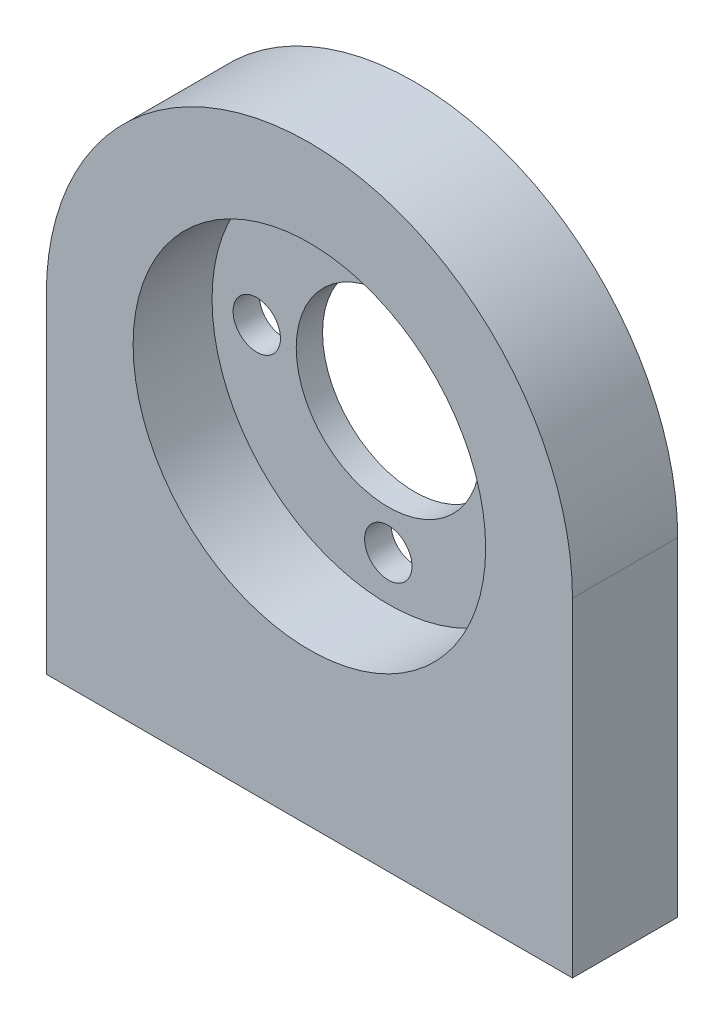
ISO-10303-21;
HEADER;
FILE_DESCRIPTION(('STEP AP214'),'2;1');
FILE_NAME('part.step','',(''),(''),'','','');
FILE_SCHEMA(('AUTOMOTIVE_DESIGN { 1 0 10303 214 1 1 1 1 }'));
ENDSEC;
DATA;
#1=APPLICATION_CONTEXT('core data for automotive mechanical design processes');
#2=APPLICATION_PROTOCOL_DEFINITION('international standard','automotive_design',2000,#1);
#3=PRODUCT_CONTEXT('',#1,'mechanical');
#4=PRODUCT('Part','Part','',(#3));
#5=PRODUCT_RELATED_PRODUCT_CATEGORY('part','',(#4));
#6=PRODUCT_DEFINITION_FORMATION('','',#4);
#7=PRODUCT_DEFINITION_CONTEXT('part definition',#1,'design');
#8=PRODUCT_DEFINITION('design','',#6,#7);
#9=PRODUCT_DEFINITION_SHAPE('','',#8);
#10=(LENGTH_UNIT() NAMED_UNIT(*) SI_UNIT(.MILLI.,.METRE.));
#11=(NAMED_UNIT(*) PLANE_ANGLE_UNIT() SI_UNIT($,.RADIAN.));
#12=(NAMED_UNIT(*) SI_UNIT($,.STERADIAN.) SOLID_ANGLE_UNIT());
#13=UNCERTAINTY_MEASURE_WITH_UNIT(LENGTH_MEASURE(1.E-05),#10,'distance_accuracy_value','');
#14=(GEOMETRIC_REPRESENTATION_CONTEXT(3) GLOBAL_UNCERTAINTY_ASSIGNED_CONTEXT((#13)) GLOBAL_UNIT_ASSIGNED_CONTEXT((#10,
#11,#12)) REPRESENTATION_CONTEXT('',''));
#15=CARTESIAN_POINT('',(0.,0.,0.));
#16=DIRECTION('',(0.,0.,1.));
#17=DIRECTION('',(1.,0.,0.));
#18=AXIS2_PLACEMENT_3D('',#15,#16,#17);
#19=CARTESIAN_POINT('',(0.,0.,8.));
#20=DIRECTION('',(0.,0.,-1.));
#21=DIRECTION('',(-1.,0.,0.));
#22=AXIS2_PLACEMENT_3D('',#19,#20,#21);
#23=CYLINDRICAL_SURFACE('',#22,7.);
#24=CARTESIAN_POINT('',(0.,0.,0.));
#25=DIRECTION('',(0.,0.,1.));
#26=DIRECTION('',(1.,0.,0.));
#27=AXIS2_PLACEMENT_3D('',#24,#25,#26);
#28=CIRCLE('',#27,7.);
#29=CARTESIAN_POINT('',(7.,0.,0.));
#30=VERTEX_POINT('',#29);
#31=EDGE_CURVE('E113',#30,#30,#28,.T.);
#32=ORIENTED_EDGE('',*,*,#31,.F.);
#33=EDGE_LOOP('',(#32));
#34=FACE_BOUND('',#33,.T.);
#35=CARTESIAN_POINT('',(0.,0.,2.));
#36=DIRECTION('',(0.,0.,1.));
#37=DIRECTION('',(1.,0.,0.));
#38=AXIS2_PLACEMENT_3D('',#35,#36,#37);
#39=CIRCLE('',#38,7.);
#40=CARTESIAN_POINT('',(7.,0.,2.));
#41=VERTEX_POINT('',#40);
#42=EDGE_CURVE('E169',#41,#41,#39,.T.);
#43=ORIENTED_EDGE('',*,*,#42,.T.);
#44=EDGE_LOOP('',(#43));
#45=FACE_BOUND('',#44,.T.);
#46=ADVANCED_FACE('F41',(#34,#45),#23,.F.);
#47=CARTESIAN_POINT('',(0.,10.,8.));
#48=DIRECTION('',(0.,0.,-1.));
#49=DIRECTION('',(-1.,0.,0.));
#50=AXIS2_PLACEMENT_3D('',#47,#48,#49);
#51=CYLINDRICAL_SURFACE('',#50,1.8);
#52=CARTESIAN_POINT('',(0.,10.,0.));
#53=DIRECTION('',(0.,0.,1.));
#54=DIRECTION('',(1.,0.,0.));
#55=AXIS2_PLACEMENT_3D('',#52,#53,#54);
#56=CIRCLE('',#55,1.8);
#57=CARTESIAN_POINT('',(1.8,10.,0.));
#58=VERTEX_POINT('',#57);
#59=EDGE_CURVE('E181',#58,#58,#56,.T.);
#60=ORIENTED_EDGE('',*,*,#59,.F.);
#61=EDGE_LOOP('',(#60));
#62=FACE_BOUND('',#61,.T.);
#63=CARTESIAN_POINT('',(0.,10.,2.));
#64=DIRECTION('',(0.,0.,1.));
#65=DIRECTION('',(1.,0.,0.));
#66=AXIS2_PLACEMENT_3D('',#63,#64,#65);
#67=CIRCLE('',#66,1.8);
#68=CARTESIAN_POINT('',(1.8,10.,2.));
#69=VERTEX_POINT('',#68);
#70=EDGE_CURVE('E166',#69,#69,#67,.T.);
#71=ORIENTED_EDGE('',*,*,#70,.T.);
#72=EDGE_LOOP('',(#71));
#73=FACE_BOUND('',#72,.T.);
#74=ADVANCED_FACE('F192',(#62,#73),#51,.F.);
#75=CARTESIAN_POINT('',(10.,0.,8.));
#76=DIRECTION('',(0.,0.,-1.));
#77=DIRECTION('',(-1.,0.,0.));
#78=AXIS2_PLACEMENT_3D('',#75,#76,#77);
#79=CYLINDRICAL_SURFACE('',#78,1.8);
#80=CARTESIAN_POINT('',(10.,0.,0.));
#81=DIRECTION('',(0.,0.,1.));
#82=DIRECTION('',(1.,0.,0.));
#83=AXIS2_PLACEMENT_3D('',#80,#81,#82);
#84=CIRCLE('',#83,1.8);
#85=CARTESIAN_POINT('',(11.8,0.,0.));
#86=VERTEX_POINT('',#85);
#87=EDGE_CURVE('E178',#86,#86,#84,.T.);
#88=ORIENTED_EDGE('',*,*,#87,.F.);
#89=EDGE_LOOP('',(#88));
#90=FACE_BOUND('',#89,.T.);
#91=CARTESIAN_POINT('',(10.,0.,2.));
#92=DIRECTION('',(0.,0.,1.));
#93=DIRECTION('',(1.,0.,0.));
#94=AXIS2_PLACEMENT_3D('',#91,#92,#93);
#95=CIRCLE('',#94,1.8);
#96=CARTESIAN_POINT('',(11.8,0.,2.));
#97=VERTEX_POINT('',#96);
#98=EDGE_CURVE('E163',#97,#97,#95,.T.);
#99=ORIENTED_EDGE('',*,*,#98,.T.);
#100=EDGE_LOOP('',(#99));
#101=FACE_BOUND('',#100,.T.);
#102=ADVANCED_FACE('F351',(#90,#101),#79,.F.);
#103=CARTESIAN_POINT('',(0.,-10.,8.));
#104=DIRECTION('',(0.,0.,-1.));
#105=DIRECTION('',(-1.,0.,0.));
#106=AXIS2_PLACEMENT_3D('',#103,#104,#105);
#107=CYLINDRICAL_SURFACE('',#106,1.80000000000007);
#108=CARTESIAN_POINT('',(0.,-10.,0.));
#109=DIRECTION('',(0.,0.,1.));
#110=DIRECTION('',(1.,0.,0.));
#111=AXIS2_PLACEMENT_3D('',#108,#109,#110);
#112=CIRCLE('',#111,1.80000000000007);
#113=CARTESIAN_POINT('',(1.80000000000007,-10.,0.));
#114=VERTEX_POINT('',#113);
#115=EDGE_CURVE('E175',#114,#114,#112,.T.);
#116=ORIENTED_EDGE('',*,*,#115,.F.);
#117=EDGE_LOOP('',(#116));
#118=FACE_BOUND('',#117,.T.);
#119=CARTESIAN_POINT('',(0.,-10.,2.));
#120=DIRECTION('',(0.,0.,1.));
#121=DIRECTION('',(1.,0.,0.));
#122=AXIS2_PLACEMENT_3D('',#119,#120,#121);
#123=CIRCLE('',#122,1.80000000000007);
#124=CARTESIAN_POINT('',(1.80000000000007,-10.,2.));
#125=VERTEX_POINT('',#124);
#126=EDGE_CURVE('E124',#125,#125,#123,.T.);
#127=ORIENTED_EDGE('',*,*,#126,.T.);
#128=EDGE_LOOP('',(#127));
#129=FACE_BOUND('',#128,.T.);
#130=ADVANCED_FACE('F226',(#118,#129),#107,.F.);
#131=CARTESIAN_POINT('',(-10.,1.04744440165294E-13,8.));
#132=DIRECTION('',(0.,0.,-1.));
#133=DIRECTION('',(-1.,0.,0.));
#134=AXIS2_PLACEMENT_3D('',#131,#132,#133);
#135=CYLINDRICAL_SURFACE('',#134,1.8);
#136=CARTESIAN_POINT('',(-10.,1.04744440165294E-13,0.));
#137=DIRECTION('',(0.,0.,1.));
#138=DIRECTION('',(1.,0.,0.));
#139=AXIS2_PLACEMENT_3D('',#136,#137,#138);
#140=CIRCLE('',#139,1.8);
#141=CARTESIAN_POINT('',(-8.2,1.04744440165294E-13,0.));
#142=VERTEX_POINT('',#141);
#143=EDGE_CURVE('E172',#142,#142,#140,.T.);
#144=ORIENTED_EDGE('',*,*,#143,.F.);
#145=EDGE_LOOP('',(#144));
#146=FACE_BOUND('',#145,.T.);
#147=CARTESIAN_POINT('',(-10.,1.04744440165294E-13,2.));
#148=DIRECTION('',(0.,0.,1.));
#149=DIRECTION('',(1.,0.,0.));
#150=AXIS2_PLACEMENT_3D('',#147,#148,#149);
#151=CIRCLE('',#150,1.8);
#152=CARTESIAN_POINT('',(-8.2,1.04744440165294E-13,2.));
#153=VERTEX_POINT('',#152);
#154=EDGE_CURVE('E121',#153,#153,#151,.T.);
#155=ORIENTED_EDGE('',*,*,#154,.T.);
#156=EDGE_LOOP('',(#155));
#157=FACE_BOUND('',#156,.T.);
#158=ADVANCED_FACE('F217',(#146,#157),#135,.F.);
#159=CARTESIAN_POINT('',(0.,0.,8.));
#160=DIRECTION('',(0.,0.,-1.));
#161=DIRECTION('',(-1.,0.,0.));
#162=AXIS2_PLACEMENT_3D('',#159,#160,#161);
#163=PLANE('',#162);
#164=CARTESIAN_POINT('',(0.,0.,8.));
#165=DIRECTION('',(0.,0.,1.));
#166=DIRECTION('',(1.,0.,0.));
#167=AXIS2_PLACEMENT_3D('',#164,#165,#166);
#168=CIRCLE('',#167,13.4);
#169=CARTESIAN_POINT('',(13.4,0.,8.));
#170=VERTEX_POINT('',#169);
#171=EDGE_CURVE('E154',#170,#170,#168,.T.);
#172=ORIENTED_EDGE('',*,*,#171,.F.);
#173=EDGE_LOOP('',(#172));
#174=FACE_BOUND('',#173,.T.);
#175=CARTESIAN_POINT('',(0.,0.,8.));
#176=DIRECTION('',(0.,0.,1.));
#177=DIRECTION('',(-1.,0.,0.));
#178=AXIS2_PLACEMENT_3D('',#175,#176,#177);
#179=CIRCLE('',#178,20.);
#180=CARTESIAN_POINT('',(20.,0.,8.));
#181=VERTEX_POINT('',#180);
#182=CARTESIAN_POINT('',(-20.,0.,8.));
#183=VERTEX_POINT('',#182);
#184=EDGE_CURVE('E95',#181,#183,#179,.T.);
#185=ORIENTED_EDGE('',*,*,#184,.T.);
#186=DIRECTION('',(0.,-1.,0.));
#187=VECTOR('',#186,1.);
#188=CARTESIAN_POINT('',(-20.,0.,8.));
#189=LINE('',#188,#187);
#190=CARTESIAN_POINT('',(-20.,-25.,8.));
#191=VERTEX_POINT('',#190);
#192=EDGE_CURVE('E90',#183,#191,#189,.T.);
#193=ORIENTED_EDGE('',*,*,#192,.T.);
#194=DIRECTION('',(1.,0.,0.));
#195=VECTOR('',#194,1.);
#196=CARTESIAN_POINT('',(-20.,-25.,8.));
#197=LINE('',#196,#195);
#198=CARTESIAN_POINT('',(20.,-25.,8.));
#199=VERTEX_POINT('',#198);
#200=EDGE_CURVE('E93',#191,#199,#197,.T.);
#201=ORIENTED_EDGE('',*,*,#200,.T.);
#202=DIRECTION('',(0.,1.,0.));
#203=VECTOR('',#202,1.);
#204=CARTESIAN_POINT('',(20.,0.,8.));
#205=LINE('',#204,#203);
#206=EDGE_CURVE('E59',#199,#181,#205,.T.);
#207=ORIENTED_EDGE('',*,*,#206,.T.);
#208=EDGE_LOOP('',(#185,#193,#201,#207));
#209=FACE_BOUND('',#208,.T.);
#210=ADVANCED_FACE('F91',(#174,#209),#163,.F.);
#211=CARTESIAN_POINT('',(0.,0.,0.));
#212=DIRECTION('',(0.,0.,-1.));
#213=DIRECTION('',(-1.,0.,0.));
#214=AXIS2_PLACEMENT_3D('',#211,#212,#213);
#215=PLANE('',#214);
#216=ORIENTED_EDGE('',*,*,#115,.T.);
#217=EDGE_LOOP('',(#216));
#218=FACE_BOUND('',#217,.T.);
#219=ORIENTED_EDGE('',*,*,#59,.T.);
#220=EDGE_LOOP('',(#219));
#221=FACE_BOUND('',#220,.T.);
#222=CARTESIAN_POINT('',(0.,0.,0.));
#223=DIRECTION('',(0.,0.,1.));
#224=DIRECTION('',(-1.,0.,0.));
#225=AXIS2_PLACEMENT_3D('',#222,#223,#224);
#226=CIRCLE('',#225,20.);
#227=CARTESIAN_POINT('',(20.,0.,0.));
#228=VERTEX_POINT('',#227);
#229=CARTESIAN_POINT('',(-20.,0.,0.));
#230=VERTEX_POINT('',#229);
#231=EDGE_CURVE('E110',#228,#230,#226,.T.);
#232=ORIENTED_EDGE('',*,*,#231,.F.);
#233=DIRECTION('',(0.,1.,0.));
#234=VECTOR('',#233,1.);
#235=CARTESIAN_POINT('',(20.,0.,0.));
#236=LINE('',#235,#234);
#237=CARTESIAN_POINT('',(20.,-25.,0.));
#238=VERTEX_POINT('',#237);
#239=EDGE_CURVE('E82',#238,#228,#236,.T.);
#240=ORIENTED_EDGE('',*,*,#239,.F.);
#241=DIRECTION('',(1.,0.,0.));
#242=VECTOR('',#241,1.);
#243=CARTESIAN_POINT('',(-20.,-25.,0.));
#244=LINE('',#243,#242);
#245=CARTESIAN_POINT('',(-20.,-25.,0.));
#246=VERTEX_POINT('',#245);
#247=EDGE_CURVE('E76',#246,#238,#244,.T.);
#248=ORIENTED_EDGE('',*,*,#247,.F.);
#249=DIRECTION('',(0.,-1.,0.));
#250=VECTOR('',#249,1.);
#251=CARTESIAN_POINT('',(-20.,0.,0.));
#252=LINE('',#251,#250);
#253=EDGE_CURVE('E100',#230,#246,#252,.T.);
#254=ORIENTED_EDGE('',*,*,#253,.F.);
#255=EDGE_LOOP('',(#232,#240,#248,#254));
#256=FACE_BOUND('',#255,.T.);
#257=ORIENTED_EDGE('',*,*,#31,.T.);
#258=EDGE_LOOP('',(#257));
#259=FACE_BOUND('',#258,.T.);
#260=ORIENTED_EDGE('',*,*,#87,.T.);
#261=EDGE_LOOP('',(#260));
#262=FACE_BOUND('',#261,.T.);
#263=ORIENTED_EDGE('',*,*,#143,.T.);
#264=EDGE_LOOP('',(#263));
#265=FACE_BOUND('',#264,.T.);
#266=ADVANCED_FACE('F187',(#218,#221,#256,#259,#262,#265),#215,.T.);
#267=CARTESIAN_POINT('',(0.,0.,8.));
#268=DIRECTION('',(0.,0.,-1.));
#269=DIRECTION('',(-1.,0.,0.));
#270=AXIS2_PLACEMENT_3D('',#267,#268,#269);
#271=CYLINDRICAL_SURFACE('',#270,20.);
#272=ORIENTED_EDGE('',*,*,#231,.T.);
#273=DIRECTION('',(0.,0.,-1.));
#274=VECTOR('',#273,1.);
#275=CARTESIAN_POINT('',(-20.,0.,8.));
#276=LINE('',#275,#274);
#277=EDGE_CURVE('E101',#183,#230,#276,.T.);
#278=ORIENTED_EDGE('',*,*,#277,.F.);
#279=ORIENTED_EDGE('',*,*,#184,.F.);
#280=DIRECTION('',(0.,0.,-1.));
#281=VECTOR('',#280,1.);
#282=CARTESIAN_POINT('',(20.,0.,8.));
#283=LINE('',#282,#281);
#284=EDGE_CURVE('E106',#181,#228,#283,.T.);
#285=ORIENTED_EDGE('',*,*,#284,.T.);
#286=EDGE_LOOP('',(#272,#278,#279,#285));
#287=FACE_BOUND('',#286,.T.);
#288=ADVANCED_FACE('F223',(#287),#271,.T.);
#289=CARTESIAN_POINT('',(-20.,0.,8.));
#290=DIRECTION('',(1.,0.,0.));
#291=DIRECTION('',(0.,1.,0.));
#292=AXIS2_PLACEMENT_3D('',#289,#290,#291);
#293=PLANE('',#292);
#294=ORIENTED_EDGE('',*,*,#253,.T.);
#295=DIRECTION('',(0.,0.,-1.));
#296=VECTOR('',#295,1.);
#297=CARTESIAN_POINT('',(-20.,-25.,8.));
#298=LINE('',#297,#296);
#299=EDGE_CURVE('E98',#191,#246,#298,.T.);
#300=ORIENTED_EDGE('',*,*,#299,.F.);
#301=ORIENTED_EDGE('',*,*,#192,.F.);
#302=ORIENTED_EDGE('',*,*,#277,.T.);
#303=EDGE_LOOP('',(#294,#300,#301,#302));
#304=FACE_BOUND('',#303,.T.);
#305=ADVANCED_FACE('F99',(#304),#293,.F.);
#306=CARTESIAN_POINT('',(-20.,-25.,8.));
#307=DIRECTION('',(0.,1.,0.));
#308=DIRECTION('',(0.,0.,1.));
#309=AXIS2_PLACEMENT_3D('',#306,#307,#308);
#310=PLANE('',#309);
#311=CARTESIAN_POINT('',(15.,-25.,4.));
#312=DIRECTION('',(0.,1.,0.));
#313=DIRECTION('',(0.,0.,1.));
#314=AXIS2_PLACEMENT_3D('',#311,#312,#313);
#315=CIRCLE('',#314,3.);
#316=CARTESIAN_POINT('',(15.,-25.,7.00000000000001));
#317=VERTEX_POINT('',#316);
#318=EDGE_CURVE('E51',#317,#317,#315,.T.);
#319=ORIENTED_EDGE('',*,*,#318,.T.);
#320=EDGE_LOOP('',(#319));
#321=FACE_BOUND('',#320,.T.);
#322=CARTESIAN_POINT('',(-15.,-25.,4.));
#323=DIRECTION('',(0.,1.,0.));
#324=DIRECTION('',(0.,0.,1.));
#325=AXIS2_PLACEMENT_3D('',#322,#323,#324);
#326=CIRCLE('',#325,3.);
#327=CARTESIAN_POINT('',(-15.,-25.,7.));
#328=VERTEX_POINT('',#327);
#329=EDGE_CURVE('E128',#328,#328,#326,.T.);
#330=ORIENTED_EDGE('',*,*,#329,.T.);
#331=EDGE_LOOP('',(#330));
#332=FACE_BOUND('',#331,.T.);
#333=ORIENTED_EDGE('',*,*,#247,.T.);
#334=DIRECTION('',(0.,0.,-1.));
#335=VECTOR('',#334,1.);
#336=CARTESIAN_POINT('',(20.,-25.,8.));
#337=LINE('',#336,#335);
#338=EDGE_CURVE('E102',#199,#238,#337,.T.);
#339=ORIENTED_EDGE('',*,*,#338,.F.);
#340=ORIENTED_EDGE('',*,*,#200,.F.);
#341=ORIENTED_EDGE('',*,*,#299,.T.);
#342=EDGE_LOOP('',(#333,#339,#340,#341));
#343=FACE_BOUND('',#342,.T.);
#344=ADVANCED_FACE('F104',(#321,#332,#343),#310,.F.);
#345=CARTESIAN_POINT('',(20.,0.,8.));
#346=DIRECTION('',(-1.,0.,0.));
#347=DIRECTION('',(0.,-1.,0.));
#348=AXIS2_PLACEMENT_3D('',#345,#346,#347);
#349=PLANE('',#348);
#350=ORIENTED_EDGE('',*,*,#239,.T.);
#351=ORIENTED_EDGE('',*,*,#284,.F.);
#352=ORIENTED_EDGE('',*,*,#206,.F.);
#353=ORIENTED_EDGE('',*,*,#338,.T.);
#354=EDGE_LOOP('',(#350,#351,#352,#353));
#355=FACE_BOUND('',#354,.T.);
#356=ADVANCED_FACE('F212',(#355),#349,.F.);
#357=CARTESIAN_POINT('',(0.,0.,2.));
#358=DIRECTION('',(0.,0.,1.));
#359=DIRECTION('',(1.,0.,0.));
#360=AXIS2_PLACEMENT_3D('',#357,#358,#359);
#361=CYLINDRICAL_SURFACE('',#360,13.4);
#362=CARTESIAN_POINT('',(0.,0.,2.));
#363=DIRECTION('',(0.,0.,1.));
#364=DIRECTION('',(1.,0.,0.));
#365=AXIS2_PLACEMENT_3D('',#362,#363,#364);
#366=CIRCLE('',#365,13.4);
#367=CARTESIAN_POINT('',(13.4,0.,2.));
#368=VERTEX_POINT('',#367);
#369=EDGE_CURVE('E125',#368,#368,#366,.T.);
#370=ORIENTED_EDGE('',*,*,#369,.F.);
#371=EDGE_LOOP('',(#370));
#372=FACE_BOUND('',#371,.T.);
#373=ORIENTED_EDGE('',*,*,#171,.T.);
#374=EDGE_LOOP('',(#373));
#375=FACE_BOUND('',#374,.T.);
#376=ADVANCED_FACE('F198',(#372,#375),#361,.F.);
#377=CARTESIAN_POINT('',(0.,0.,2.));
#378=DIRECTION('',(0.,0.,1.));
#379=DIRECTION('',(1.,0.,0.));
#380=AXIS2_PLACEMENT_3D('',#377,#378,#379);
#381=PLANE('',#380);
#382=ORIENTED_EDGE('',*,*,#42,.F.);
#383=EDGE_LOOP('',(#382));
#384=FACE_BOUND('',#383,.T.);
#385=ORIENTED_EDGE('',*,*,#70,.F.);
#386=EDGE_LOOP('',(#385));
#387=FACE_BOUND('',#386,.T.);
#388=ORIENTED_EDGE('',*,*,#98,.F.);
#389=EDGE_LOOP('',(#388));
#390=FACE_BOUND('',#389,.T.);
#391=ORIENTED_EDGE('',*,*,#126,.F.);
#392=EDGE_LOOP('',(#391));
#393=FACE_BOUND('',#392,.T.);
#394=ORIENTED_EDGE('',*,*,#154,.F.);
#395=EDGE_LOOP('',(#394));
#396=FACE_BOUND('',#395,.T.);
#397=ORIENTED_EDGE('',*,*,#369,.T.);
#398=EDGE_LOOP('',(#397));
#399=FACE_BOUND('',#398,.T.);
#400=ADVANCED_FACE('F145',(#384,#387,#390,#393,#396,#399),#381,.T.);
#401=CARTESIAN_POINT('',(15.,-13.,4.));
#402=DIRECTION('',(0.,-1.,0.));
#403=DIRECTION('',(0.,0.,-1.));
#404=AXIS2_PLACEMENT_3D('',#401,#402,#403);
#405=CYLINDRICAL_SURFACE('',#404,2.);
#406=CARTESIAN_POINT('',(15.,-24.,4.));
#407=DIRECTION('',(0.,1.,0.));
#408=DIRECTION('',(0.,0.,1.));
#409=AXIS2_PLACEMENT_3D('',#406,#407,#408);
#410=CIRCLE('',#409,2.);
#411=CARTESIAN_POINT('',(15.,-24.,6.));
#412=VERTEX_POINT('',#411);
#413=EDGE_CURVE('E120',#412,#412,#410,.F.);
#414=ORIENTED_EDGE('',*,*,#413,.T.);
#415=EDGE_LOOP('',(#414));
#416=FACE_BOUND('',#415,.T.);
#417=CARTESIAN_POINT('',(15.,-13.,4.));
#418=DIRECTION('',(0.,-1.,0.));
#419=DIRECTION('',(0.,0.,-1.));
#420=AXIS2_PLACEMENT_3D('',#417,#418,#419);
#421=CIRCLE('',#420,2.);
#422=CARTESIAN_POINT('',(15.,-13.,2.));
#423=VERTEX_POINT('',#422);
#424=EDGE_CURVE('E149',#423,#423,#421,.T.);
#425=ORIENTED_EDGE('',*,*,#424,.F.);
#426=EDGE_LOOP('',(#425));
#427=FACE_BOUND('',#426,.T.);
#428=ADVANCED_FACE('F141',(#416,#427),#405,.F.);
#429=CARTESIAN_POINT('',(15.,-13.,4.));
#430=DIRECTION('',(0.,-1.,0.));
#431=DIRECTION('',(0.,0.,-1.));
#432=AXIS2_PLACEMENT_3D('',#429,#430,#431);
#433=PLANE('',#432);
#434=ORIENTED_EDGE('',*,*,#424,.T.);
#435=EDGE_LOOP('',(#434));
#436=FACE_BOUND('',#435,.T.);
#437=ADVANCED_FACE('F144',(#436),#433,.T.);
#438=CARTESIAN_POINT('',(-15.,-13.,4.));
#439=DIRECTION('',(0.,-1.,0.));
#440=DIRECTION('',(0.,0.,-1.));
#441=AXIS2_PLACEMENT_3D('',#438,#439,#440);
#442=CYLINDRICAL_SURFACE('',#441,2.);
#443=CARTESIAN_POINT('',(-15.,-24.,4.));
#444=DIRECTION('',(0.,1.,0.));
#445=DIRECTION('',(0.,0.,1.));
#446=AXIS2_PLACEMENT_3D('',#443,#444,#445);
#447=CIRCLE('',#446,2.);
#448=CARTESIAN_POINT('',(-15.,-24.,6.));
#449=VERTEX_POINT('',#448);
#450=EDGE_CURVE('E11',#449,#449,#447,.F.);
#451=ORIENTED_EDGE('',*,*,#450,.T.);
#452=EDGE_LOOP('',(#451));
#453=FACE_BOUND('',#452,.T.);
#454=CARTESIAN_POINT('',(-15.,-13.,4.));
#455=DIRECTION('',(0.,-1.,0.));
#456=DIRECTION('',(0.,0.,-1.));
#457=AXIS2_PLACEMENT_3D('',#454,#455,#456);
#458=CIRCLE('',#457,2.);
#459=CARTESIAN_POINT('',(-15.,-13.,2.));
#460=VERTEX_POINT('',#459);
#461=EDGE_CURVE('E151',#460,#460,#458,.T.);
#462=ORIENTED_EDGE('',*,*,#461,.F.);
#463=EDGE_LOOP('',(#462));
#464=FACE_BOUND('',#463,.T.);
#465=ADVANCED_FACE('F283',(#453,#464),#442,.F.);
#466=CARTESIAN_POINT('',(-15.,-13.,4.));
#467=DIRECTION('',(0.,-1.,0.));
#468=DIRECTION('',(0.,0.,-1.));
#469=AXIS2_PLACEMENT_3D('',#466,#467,#468);
#470=PLANE('',#469);
#471=ORIENTED_EDGE('',*,*,#461,.T.);
#472=EDGE_LOOP('',(#471));
#473=FACE_BOUND('',#472,.T.);
#474=ADVANCED_FACE('F138',(#473),#470,.T.);
#475=CARTESIAN_POINT('',(15.,-24.,4.));
#476=DIRECTION('',(0.,-1.,0.));
#477=DIRECTION('',(0.,0.,-1.));
#478=AXIS2_PLACEMENT_3D('',#475,#476,#477);
#479=CONICAL_SURFACE('',#478,2.,0.785398163397447);
#480=ORIENTED_EDGE('',*,*,#318,.F.);
#481=EDGE_LOOP('',(#480));
#482=FACE_BOUND('',#481,.T.);
#483=ORIENTED_EDGE('',*,*,#413,.F.);
#484=EDGE_LOOP('',(#483));
#485=FACE_BOUND('',#484,.T.);
#486=ADVANCED_FACE('F135',(#482,#485),#479,.F.);
#487=CARTESIAN_POINT('',(-15.,-24.,4.));
#488=DIRECTION('',(0.,-1.,0.));
#489=DIRECTION('',(0.,0.,-1.));
#490=AXIS2_PLACEMENT_3D('',#487,#488,#489);
#491=CONICAL_SURFACE('',#490,2.,0.785398163397447);
#492=ORIENTED_EDGE('',*,*,#329,.F.);
#493=EDGE_LOOP('',(#492));
#494=FACE_BOUND('',#493,.T.);
#495=ORIENTED_EDGE('',*,*,#450,.F.);
#496=EDGE_LOOP('',(#495));
#497=FACE_BOUND('',#496,.T.);
#498=ADVANCED_FACE('F44',(#494,#497),#491,.F.);
#499=CLOSED_SHELL('',(#46,#74,#102,#130,#158,#210,#266,#288,#305,#344,#356,#376,#400,#428,#437,
#465,#474,#486,#498));
#500=MANIFOLD_SOLID_BREP('B2',#499);
#501=ADVANCED_BREP_SHAPE_REPRESENTATION('',(#18,#500),#14);
#502=SHAPE_DEFINITION_REPRESENTATION(#9,#501);
ENDSEC;
END-ISO-10303-21;
